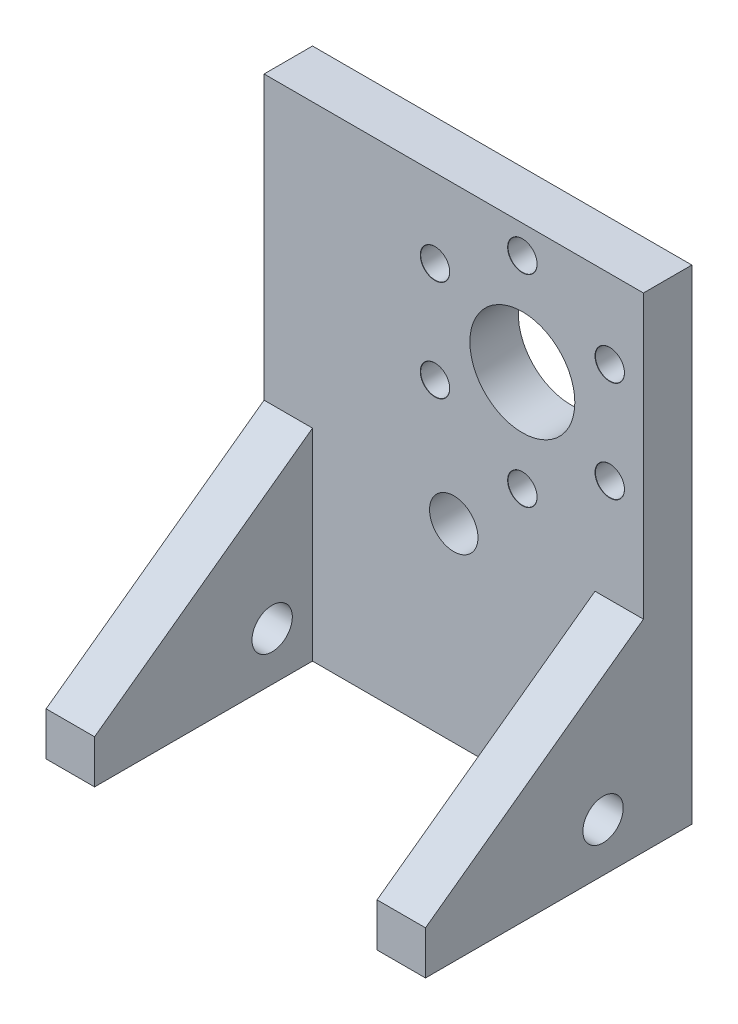
ISO-10303-21;
HEADER;
FILE_DESCRIPTION(('STEP AP214'),'2;1');
FILE_NAME('part.step','',(''),(''),'','','');
FILE_SCHEMA(('AUTOMOTIVE_DESIGN { 1 0 10303 214 1 1 1 1 }'));
ENDSEC;
DATA;
#1=APPLICATION_CONTEXT('core data for automotive mechanical design processes');
#2=APPLICATION_PROTOCOL_DEFINITION('international standard','automotive_design',2000,#1);
#3=PRODUCT_CONTEXT('',#1,'mechanical');
#4=PRODUCT('Part','Part','',(#3));
#5=PRODUCT_RELATED_PRODUCT_CATEGORY('part','',(#4));
#6=PRODUCT_DEFINITION_FORMATION('','',#4);
#7=PRODUCT_DEFINITION_CONTEXT('part definition',#1,'design');
#8=PRODUCT_DEFINITION('design','',#6,#7);
#9=PRODUCT_DEFINITION_SHAPE('','',#8);
#10=(LENGTH_UNIT() NAMED_UNIT(*) SI_UNIT(.MILLI.,.METRE.));
#11=(NAMED_UNIT(*) PLANE_ANGLE_UNIT() SI_UNIT($,.RADIAN.));
#12=(NAMED_UNIT(*) SI_UNIT($,.STERADIAN.) SOLID_ANGLE_UNIT());
#13=UNCERTAINTY_MEASURE_WITH_UNIT(LENGTH_MEASURE(1.E-05),#10,'distance_accuracy_value','');
#14=(GEOMETRIC_REPRESENTATION_CONTEXT(3) GLOBAL_UNCERTAINTY_ASSIGNED_CONTEXT((#13)) GLOBAL_UNIT_ASSIGNED_CONTEXT((#10,
#11,#12)) REPRESENTATION_CONTEXT('',''));
#15=CARTESIAN_POINT('',(0.,0.,0.));
#16=DIRECTION('',(0.,0.,1.));
#17=DIRECTION('',(1.,0.,0.));
#18=AXIS2_PLACEMENT_3D('',#15,#16,#17);
#19=CARTESIAN_POINT('',(-17.5,5.,0.));
#20=DIRECTION('',(-1.,0.,0.));
#21=DIRECTION('',(0.,0.,1.));
#22=AXIS2_PLACEMENT_3D('',#19,#20,#21);
#23=PLANE('',#22);
#24=CARTESIAN_POINT('',(-17.5,6.,5.));
#25=DIRECTION('',(-1.,0.,0.));
#26=DIRECTION('',(0.,0.,1.));
#27=AXIS2_PLACEMENT_3D('',#24,#25,#26);
#28=CIRCLE('',#27,2.5);
#29=CARTESIAN_POINT('',(-17.5,6.,7.5));
#30=VERTEX_POINT('',#29);
#31=EDGE_CURVE('E459',#30,#30,#28,.T.);
#32=ORIENTED_EDGE('',*,*,#31,.T.);
#33=EDGE_LOOP('',(#32));
#34=FACE_BOUND('',#33,.T.);
#35=DIRECTION('',(0.,0.,-1.));
#36=VECTOR('',#35,1.);
#37=CARTESIAN_POINT('',(-17.5,0.,0.));
#38=LINE('',#37,#36);
#39=CARTESIAN_POINT('',(-17.5,0.,27.));
#40=VERTEX_POINT('',#39);
#41=CARTESIAN_POINT('',(-17.5,0.,0.));
#42=VERTEX_POINT('',#41);
#43=EDGE_CURVE('E241',#40,#42,#38,.T.);
#44=ORIENTED_EDGE('',*,*,#43,.T.);
#45=DIRECTION('',(0.,-1.,0.));
#46=VECTOR('',#45,1.);
#47=CARTESIAN_POINT('',(-17.5,5.,0.));
#48=LINE('',#47,#46);
#49=CARTESIAN_POINT('',(-17.5,25.0000000000002,0.));
#50=VERTEX_POINT('',#49);
#51=EDGE_CURVE('E277',#50,#42,#48,.T.);
#52=ORIENTED_EDGE('',*,*,#51,.F.);
#53=DIRECTION('',(0.,-0.58778525229247,0.80901699437495));
#54=VECTOR('',#53,1.);
#55=CARTESIAN_POINT('',(-17.5,18.0901699437497,9.5105651629516));
#56=LINE('',#55,#54);
#57=CARTESIAN_POINT('',(-17.5,5.38335174385562,27.));
#58=VERTEX_POINT('',#57);
#59=EDGE_CURVE('E11',#50,#58,#56,.T.);
#60=ORIENTED_EDGE('',*,*,#59,.T.);
#61=DIRECTION('',(0.,-1.,0.));
#62=VECTOR('',#61,1.);
#63=CARTESIAN_POINT('',(-17.5,5.,27.));
#64=LINE('',#63,#62);
#65=EDGE_CURVE('E60',#58,#40,#64,.T.);
#66=ORIENTED_EDGE('',*,*,#65,.T.);
#67=EDGE_LOOP('',(#44,#52,#60,#66));
#68=FACE_BOUND('',#67,.T.);
#69=ADVANCED_FACE('F44',(#34,#68),#23,.F.);
#70=CARTESIAN_POINT('',(0.,5.,0.));
#71=DIRECTION('',(0.,0.,-1.));
#72=DIRECTION('',(-1.,0.,0.));
#73=AXIS2_PLACEMENT_3D('',#70,#71,#72);
#74=PLANE('',#73);
#75=CARTESIAN_POINT('',(0.,23.5,0.));
#76=DIRECTION('',(0.,0.,1.));
#77=DIRECTION('',(1.,0.,0.));
#78=AXIS2_PLACEMENT_3D('',#75,#76,#77);
#79=CIRCLE('',#78,3.);
#80=CARTESIAN_POINT('',(3.,23.5,0.));
#81=VERTEX_POINT('',#80);
#82=EDGE_CURVE('E460',#81,#81,#79,.T.);
#83=ORIENTED_EDGE('',*,*,#82,.F.);
#84=EDGE_LOOP('',(#83));
#85=FACE_BOUND('',#84,.T.);
#86=CARTESIAN_POINT('',(8.50000000000001,44.,0.));
#87=DIRECTION('',(0.,0.,-1.));
#88=DIRECTION('',(-1.,0.,0.));
#89=AXIS2_PLACEMENT_3D('',#86,#87,#88);
#90=CIRCLE('',#89,6.5);
#91=CARTESIAN_POINT('',(2.00000000000001,44.,0.));
#92=VERTEX_POINT('',#91);
#93=EDGE_CURVE('E168',#92,#92,#90,.T.);
#94=ORIENTED_EDGE('',*,*,#93,.T.);
#95=EDGE_LOOP('',(#94));
#96=FACE_BOUND('',#95,.T.);
#97=CARTESIAN_POINT('',(8.50000000000001,56.5,0.));
#98=DIRECTION('',(0.,0.,1.));
#99=DIRECTION('',(1.,0.,0.));
#100=AXIS2_PLACEMENT_3D('',#97,#98,#99);
#101=CIRCLE('',#100,1.825);
#102=CARTESIAN_POINT('',(10.325,56.5,0.));
#103=VERTEX_POINT('',#102);
#104=EDGE_CURVE('E171',#103,#103,#101,.T.);
#105=ORIENTED_EDGE('',*,*,#104,.F.);
#106=EDGE_LOOP('',(#105));
#107=FACE_BOUND('',#106,.T.);
#108=CARTESIAN_POINT('',(19.3253175473055,50.25,0.));
#109=DIRECTION('',(0.,0.,1.));
#110=DIRECTION('',(1.,0.,0.));
#111=AXIS2_PLACEMENT_3D('',#108,#109,#110);
#112=CIRCLE('',#111,1.825);
#113=CARTESIAN_POINT('',(21.1503175473055,50.25,0.));
#114=VERTEX_POINT('',#113);
#115=EDGE_CURVE('E180',#114,#114,#112,.T.);
#116=ORIENTED_EDGE('',*,*,#115,.F.);
#117=EDGE_LOOP('',(#116));
#118=FACE_BOUND('',#117,.T.);
#119=CARTESIAN_POINT('',(19.3253175473055,37.75,0.));
#120=DIRECTION('',(0.,0.,1.));
#121=DIRECTION('',(1.,0.,0.));
#122=AXIS2_PLACEMENT_3D('',#119,#120,#121);
#123=CIRCLE('',#122,1.825);
#124=CARTESIAN_POINT('',(21.1503175473055,37.75,0.));
#125=VERTEX_POINT('',#124);
#126=EDGE_CURVE('E189',#125,#125,#123,.T.);
#127=ORIENTED_EDGE('',*,*,#126,.F.);
#128=EDGE_LOOP('',(#127));
#129=FACE_BOUND('',#128,.T.);
#130=CARTESIAN_POINT('',(8.50000000000001,31.5,0.));
#131=DIRECTION('',(0.,0.,1.));
#132=DIRECTION('',(1.,0.,0.));
#133=AXIS2_PLACEMENT_3D('',#130,#131,#132);
#134=CIRCLE('',#133,1.825);
#135=CARTESIAN_POINT('',(10.325,31.5,0.));
#136=VERTEX_POINT('',#135);
#137=EDGE_CURVE('E198',#136,#136,#134,.T.);
#138=ORIENTED_EDGE('',*,*,#137,.F.);
#139=EDGE_LOOP('',(#138));
#140=FACE_BOUND('',#139,.T.);
#141=CARTESIAN_POINT('',(-2.32531754730549,37.75,0.));
#142=DIRECTION('',(0.,0.,1.));
#143=DIRECTION('',(1.,0.,0.));
#144=AXIS2_PLACEMENT_3D('',#141,#142,#143);
#145=CIRCLE('',#144,1.825);
#146=CARTESIAN_POINT('',(-0.500317547305486,37.75,0.));
#147=VERTEX_POINT('',#146);
#148=EDGE_CURVE('E207',#147,#147,#145,.T.);
#149=ORIENTED_EDGE('',*,*,#148,.F.);
#150=EDGE_LOOP('',(#149));
#151=FACE_BOUND('',#150,.T.);
#152=CARTESIAN_POINT('',(-2.32531754730547,50.25,0.));
#153=DIRECTION('',(0.,0.,1.));
#154=DIRECTION('',(1.,0.,0.));
#155=AXIS2_PLACEMENT_3D('',#152,#153,#154);
#156=CIRCLE('',#155,1.825);
#157=CARTESIAN_POINT('',(-0.500317547305474,50.25,0.));
#158=VERTEX_POINT('',#157);
#159=EDGE_CURVE('E216',#158,#158,#156,.T.);
#160=ORIENTED_EDGE('',*,*,#159,.F.);
#161=EDGE_LOOP('',(#160));
#162=FACE_BOUND('',#161,.T.);
#163=DIRECTION('',(0.,-1.,0.));
#164=VECTOR('',#163,1.);
#165=CARTESIAN_POINT('',(17.5,5.,0.));
#166=LINE('',#165,#164);
#167=CARTESIAN_POINT('',(17.5,25.0000000000002,0.));
#168=VERTEX_POINT('',#167);
#169=CARTESIAN_POINT('',(17.5,0.,0.));
#170=VERTEX_POINT('',#169);
#171=EDGE_CURVE('E274',#168,#170,#166,.T.);
#172=ORIENTED_EDGE('',*,*,#171,.F.);
#173=DIRECTION('',(1.,0.,0.));
#174=VECTOR('',#173,1.);
#175=CARTESIAN_POINT('',(0.,25.0000000000002,0.));
#176=LINE('',#175,#174);
#177=CARTESIAN_POINT('',(23.5,25.0000000000002,0.));
#178=VERTEX_POINT('',#177);
#179=EDGE_CURVE('E283',#168,#178,#176,.T.);
#180=ORIENTED_EDGE('',*,*,#179,.T.);
#181=DIRECTION('',(0.,-1.,0.));
#182=VECTOR('',#181,1.);
#183=CARTESIAN_POINT('',(23.5,60.,0.));
#184=LINE('',#183,#182);
#185=CARTESIAN_POINT('',(23.5,60.,0.));
#186=VERTEX_POINT('',#185);
#187=EDGE_CURVE('E237',#186,#178,#184,.T.);
#188=ORIENTED_EDGE('',*,*,#187,.F.);
#189=DIRECTION('',(-1.,0.,0.));
#190=VECTOR('',#189,1.);
#191=CARTESIAN_POINT('',(0.,60.,0.));
#192=LINE('',#191,#190);
#193=CARTESIAN_POINT('',(-23.5,60.,0.));
#194=VERTEX_POINT('',#193);
#195=EDGE_CURVE('E231',#186,#194,#192,.T.);
#196=ORIENTED_EDGE('',*,*,#195,.T.);
#197=DIRECTION('',(0.,-1.,0.));
#198=VECTOR('',#197,1.);
#199=CARTESIAN_POINT('',(-23.5,60.,0.));
#200=LINE('',#199,#198);
#201=CARTESIAN_POINT('',(-23.5,25.0000000000002,0.));
#202=VERTEX_POINT('',#201);
#203=EDGE_CURVE('E238',#194,#202,#200,.T.);
#204=ORIENTED_EDGE('',*,*,#203,.T.);
#205=DIRECTION('',(1.,0.,0.));
#206=VECTOR('',#205,1.);
#207=CARTESIAN_POINT('',(0.,25.0000000000002,0.));
#208=LINE('',#207,#206);
#209=EDGE_CURVE('E280',#202,#50,#208,.T.);
#210=ORIENTED_EDGE('',*,*,#209,.T.);
#211=ORIENTED_EDGE('',*,*,#51,.T.);
#212=DIRECTION('',(1.,0.,0.));
#213=VECTOR('',#212,1.);
#214=CARTESIAN_POINT('',(0.,0.,0.));
#215=LINE('',#214,#213);
#216=EDGE_CURVE('E246',#42,#170,#215,.T.);
#217=ORIENTED_EDGE('',*,*,#216,.T.);
#218=EDGE_LOOP('',(#172,#180,#188,#196,#204,#210,#211,#217));
#219=FACE_BOUND('',#218,.T.);
#220=ADVANCED_FACE('F303',(#85,#96,#107,#118,#129,#140,#151,#162,#219),#74,.F.);
#221=CARTESIAN_POINT('',(17.5,5.,0.));
#222=DIRECTION('',(1.,0.,0.));
#223=DIRECTION('',(0.,0.,-1.));
#224=AXIS2_PLACEMENT_3D('',#221,#222,#223);
#225=PLANE('',#224);
#226=CARTESIAN_POINT('',(17.5,6.,5.));
#227=DIRECTION('',(1.,0.,0.));
#228=DIRECTION('',(0.,0.,-1.));
#229=AXIS2_PLACEMENT_3D('',#226,#227,#228);
#230=CIRCLE('',#229,2.5);
#231=CARTESIAN_POINT('',(17.5,6.,2.5));
#232=VERTEX_POINT('',#231);
#233=EDGE_CURVE('E461',#232,#232,#230,.T.);
#234=ORIENTED_EDGE('',*,*,#233,.T.);
#235=EDGE_LOOP('',(#234));
#236=FACE_BOUND('',#235,.T.);
#237=DIRECTION('',(0.,0.,1.));
#238=VECTOR('',#237,1.);
#239=CARTESIAN_POINT('',(17.5,0.,0.));
#240=LINE('',#239,#238);
#241=CARTESIAN_POINT('',(17.5,0.,27.));
#242=VERTEX_POINT('',#241);
#243=EDGE_CURVE('E248',#170,#242,#240,.T.);
#244=ORIENTED_EDGE('',*,*,#243,.T.);
#245=DIRECTION('',(0.,-1.,0.));
#246=VECTOR('',#245,1.);
#247=CARTESIAN_POINT('',(17.5,5.,27.));
#248=LINE('',#247,#246);
#249=CARTESIAN_POINT('',(17.5,5.38335174385562,27.));
#250=VERTEX_POINT('',#249);
#251=EDGE_CURVE('E271',#250,#242,#248,.T.);
#252=ORIENTED_EDGE('',*,*,#251,.F.);
#253=DIRECTION('',(0.,0.58778525229247,-0.80901699437495));
#254=VECTOR('',#253,1.);
#255=CARTESIAN_POINT('',(17.5,18.0901699437497,9.5105651629516));
#256=LINE('',#255,#254);
#257=EDGE_CURVE('E289',#250,#168,#256,.T.);
#258=ORIENTED_EDGE('',*,*,#257,.T.);
#259=ORIENTED_EDGE('',*,*,#171,.T.);
#260=EDGE_LOOP('',(#244,#252,#258,#259));
#261=FACE_BOUND('',#260,.T.);
#262=ADVANCED_FACE('F312',(#236,#261),#225,.F.);
#263=CARTESIAN_POINT('',(0.,5.,27.));
#264=DIRECTION('',(0.,0.,-1.));
#265=DIRECTION('',(-1.,0.,0.));
#266=AXIS2_PLACEMENT_3D('',#263,#264,#265);
#267=PLANE('',#266);
#268=DIRECTION('',(1.,0.,0.));
#269=VECTOR('',#268,1.);
#270=CARTESIAN_POINT('',(0.,0.,27.));
#271=LINE('',#270,#269);
#272=CARTESIAN_POINT('',(23.5,0.,27.));
#273=VERTEX_POINT('',#272);
#274=EDGE_CURVE('E250',#242,#273,#271,.T.);
#275=ORIENTED_EDGE('',*,*,#274,.T.);
#276=DIRECTION('',(0.,-1.,0.));
#277=VECTOR('',#276,1.);
#278=CARTESIAN_POINT('',(23.5,5.,27.));
#279=LINE('',#278,#277);
#280=CARTESIAN_POINT('',(23.5,5.38335174385562,27.));
#281=VERTEX_POINT('',#280);
#282=EDGE_CURVE('E268',#281,#273,#279,.T.);
#283=ORIENTED_EDGE('',*,*,#282,.F.);
#284=DIRECTION('',(-1.,0.,0.));
#285=VECTOR('',#284,1.);
#286=CARTESIAN_POINT('',(0.,5.38335174385565,27.));
#287=LINE('',#286,#285);
#288=EDGE_CURVE('E286',#281,#250,#287,.T.);
#289=ORIENTED_EDGE('',*,*,#288,.T.);
#290=ORIENTED_EDGE('',*,*,#251,.T.);
#291=EDGE_LOOP('',(#275,#283,#289,#290));
#292=FACE_BOUND('',#291,.T.);
#293=ADVANCED_FACE('F320',(#292),#267,.F.);
#294=CARTESIAN_POINT('',(23.5,5.,0.));
#295=DIRECTION('',(-1.,0.,0.));
#296=DIRECTION('',(0.,0.,1.));
#297=AXIS2_PLACEMENT_3D('',#294,#295,#296);
#298=PLANE('',#297);
#299=CARTESIAN_POINT('',(23.5,6.,4.99999999999999));
#300=DIRECTION('',(-1.,0.,0.));
#301=DIRECTION('',(0.,0.,1.));
#302=AXIS2_PLACEMENT_3D('',#299,#300,#301);
#303=CIRCLE('',#302,2.5);
#304=CARTESIAN_POINT('',(23.5,6.,7.5));
#305=VERTEX_POINT('',#304);
#306=EDGE_CURVE('E465',#305,#305,#303,.T.);
#307=ORIENTED_EDGE('',*,*,#306,.T.);
#308=EDGE_LOOP('',(#307));
#309=FACE_BOUND('',#308,.T.);
#310=DIRECTION('',(0.,0.,-1.));
#311=VECTOR('',#310,1.);
#312=CARTESIAN_POINT('',(23.5,0.,0.));
#313=LINE('',#312,#311);
#314=CARTESIAN_POINT('',(23.5,0.,-6.));
#315=VERTEX_POINT('',#314);
#316=EDGE_CURVE('E252',#273,#315,#313,.T.);
#317=ORIENTED_EDGE('',*,*,#316,.T.);
#318=DIRECTION('',(0.,-1.,0.));
#319=VECTOR('',#318,1.);
#320=CARTESIAN_POINT('',(23.5,5.,-6.));
#321=LINE('',#320,#319);
#322=CARTESIAN_POINT('',(23.5,60.,-6.));
#323=VERTEX_POINT('',#322);
#324=EDGE_CURVE('E265',#323,#315,#321,.T.);
#325=ORIENTED_EDGE('',*,*,#324,.F.);
#326=DIRECTION('',(0.,0.,1.));
#327=VECTOR('',#326,1.);
#328=CARTESIAN_POINT('',(23.5,60.,0.));
#329=LINE('',#328,#327);
#330=EDGE_CURVE('E228',#323,#186,#329,.T.);
#331=ORIENTED_EDGE('',*,*,#330,.T.);
#332=ORIENTED_EDGE('',*,*,#187,.T.);
#333=DIRECTION('',(0.,-0.58778525229247,0.80901699437495));
#334=VECTOR('',#333,1.);
#335=CARTESIAN_POINT('',(23.5,18.0901699437497,9.5105651629516));
#336=LINE('',#335,#334);
#337=EDGE_CURVE('E292',#178,#281,#336,.T.);
#338=ORIENTED_EDGE('',*,*,#337,.T.);
#339=ORIENTED_EDGE('',*,*,#282,.T.);
#340=EDGE_LOOP('',(#317,#325,#331,#332,#338,#339));
#341=FACE_BOUND('',#340,.T.);
#342=ADVANCED_FACE('F322',(#309,#341),#298,.F.);
#343=CARTESIAN_POINT('',(0.,5.,-6.));
#344=DIRECTION('',(0.,0.,1.));
#345=DIRECTION('',(1.,0.,0.));
#346=AXIS2_PLACEMENT_3D('',#343,#344,#345);
#347=PLANE('',#346);
#348=CARTESIAN_POINT('',(0.,23.5,-6.));
#349=DIRECTION('',(0.,0.,1.));
#350=DIRECTION('',(1.,0.,0.));
#351=AXIS2_PLACEMENT_3D('',#348,#349,#350);
#352=CIRCLE('',#351,3.);
#353=CARTESIAN_POINT('',(3.,23.5,-6.));
#354=VERTEX_POINT('',#353);
#355=EDGE_CURVE('E48',#354,#354,#352,.T.);
#356=ORIENTED_EDGE('',*,*,#355,.T.);
#357=EDGE_LOOP('',(#356));
#358=FACE_BOUND('',#357,.T.);
#359=CARTESIAN_POINT('',(8.50000000000001,44.,-6.00000000000001));
#360=DIRECTION('',(0.,0.,1.));
#361=DIRECTION('',(1.,0.,0.));
#362=AXIS2_PLACEMENT_3D('',#359,#360,#361);
#363=CIRCLE('',#362,6.5);
#364=CARTESIAN_POINT('',(15.,44.,-6.00000000000001));
#365=VERTEX_POINT('',#364);
#366=EDGE_CURVE('E165',#365,#365,#363,.T.);
#367=ORIENTED_EDGE('',*,*,#366,.T.);
#368=EDGE_LOOP('',(#367));
#369=FACE_BOUND('',#368,.T.);
#370=CARTESIAN_POINT('',(8.50000000000001,56.5,-6.00000000000001));
#371=DIRECTION('',(0.,0.,1.));
#372=DIRECTION('',(1.,0.,0.));
#373=AXIS2_PLACEMENT_3D('',#370,#371,#372);
#374=CIRCLE('',#373,1.79999999999999);
#375=CARTESIAN_POINT('',(10.3,56.5,-6.00000000000001));
#376=VERTEX_POINT('',#375);
#377=EDGE_CURVE('E177',#376,#376,#374,.T.);
#378=ORIENTED_EDGE('',*,*,#377,.T.);
#379=EDGE_LOOP('',(#378));
#380=FACE_BOUND('',#379,.T.);
#381=CARTESIAN_POINT('',(19.3253175473055,50.25,-6.00000000000001));
#382=DIRECTION('',(0.,0.,1.));
#383=DIRECTION('',(1.,0.,0.));
#384=AXIS2_PLACEMENT_3D('',#381,#382,#383);
#385=CIRCLE('',#384,1.79999999999999);
#386=CARTESIAN_POINT('',(21.1253175473055,50.25,-6.00000000000001));
#387=VERTEX_POINT('',#386);
#388=EDGE_CURVE('E186',#387,#387,#385,.T.);
#389=ORIENTED_EDGE('',*,*,#388,.T.);
#390=EDGE_LOOP('',(#389));
#391=FACE_BOUND('',#390,.T.);
#392=CARTESIAN_POINT('',(19.3253175473055,37.75,-6.00000000000001));
#393=DIRECTION('',(0.,0.,1.));
#394=DIRECTION('',(1.,0.,0.));
#395=AXIS2_PLACEMENT_3D('',#392,#393,#394);
#396=CIRCLE('',#395,1.79999999999999);
#397=CARTESIAN_POINT('',(21.1253175473055,37.75,-6.00000000000001));
#398=VERTEX_POINT('',#397);
#399=EDGE_CURVE('E195',#398,#398,#396,.T.);
#400=ORIENTED_EDGE('',*,*,#399,.T.);
#401=EDGE_LOOP('',(#400));
#402=FACE_BOUND('',#401,.T.);
#403=CARTESIAN_POINT('',(8.50000000000001,31.5,-6.00000000000001));
#404=DIRECTION('',(0.,0.,1.));
#405=DIRECTION('',(1.,0.,0.));
#406=AXIS2_PLACEMENT_3D('',#403,#404,#405);
#407=CIRCLE('',#406,1.79999999999999);
#408=CARTESIAN_POINT('',(10.3,31.5,-6.00000000000001));
#409=VERTEX_POINT('',#408);
#410=EDGE_CURVE('E204',#409,#409,#407,.T.);
#411=ORIENTED_EDGE('',*,*,#410,.T.);
#412=EDGE_LOOP('',(#411));
#413=FACE_BOUND('',#412,.T.);
#414=CARTESIAN_POINT('',(-2.32531754730549,37.75,-6.00000000000001));
#415=DIRECTION('',(0.,0.,1.));
#416=DIRECTION('',(1.,0.,0.));
#417=AXIS2_PLACEMENT_3D('',#414,#415,#416);
#418=CIRCLE('',#417,1.79999999999999);
#419=CARTESIAN_POINT('',(-0.525317547305499,37.75,-6.00000000000001));
#420=VERTEX_POINT('',#419);
#421=EDGE_CURVE('E213',#420,#420,#418,.T.);
#422=ORIENTED_EDGE('',*,*,#421,.T.);
#423=EDGE_LOOP('',(#422));
#424=FACE_BOUND('',#423,.T.);
#425=CARTESIAN_POINT('',(-2.32531754730547,50.25,-6.00000000000001));
#426=DIRECTION('',(0.,0.,1.));
#427=DIRECTION('',(1.,0.,0.));
#428=AXIS2_PLACEMENT_3D('',#425,#426,#427);
#429=CIRCLE('',#428,1.79999999999999);
#430=CARTESIAN_POINT('',(-0.525317547305487,50.25,-6.00000000000001));
#431=VERTEX_POINT('',#430);
#432=EDGE_CURVE('E222',#431,#431,#429,.T.);
#433=ORIENTED_EDGE('',*,*,#432,.T.);
#434=EDGE_LOOP('',(#433));
#435=FACE_BOUND('',#434,.T.);
#436=DIRECTION('',(-1.,0.,0.));
#437=VECTOR('',#436,1.);
#438=CARTESIAN_POINT('',(0.,0.,-6.));
#439=LINE('',#438,#437);
#440=CARTESIAN_POINT('',(-23.5,0.,-5.99999999999999));
#441=VERTEX_POINT('',#440);
#442=EDGE_CURVE('E254',#315,#441,#439,.T.);
#443=ORIENTED_EDGE('',*,*,#442,.T.);
#444=DIRECTION('',(0.,-1.,0.));
#445=VECTOR('',#444,1.);
#446=CARTESIAN_POINT('',(-23.5,5.,-5.99999999999999));
#447=LINE('',#446,#445);
#448=CARTESIAN_POINT('',(-23.5,60.,-5.99999999999999));
#449=VERTEX_POINT('',#448);
#450=EDGE_CURVE('E262',#449,#441,#447,.T.);
#451=ORIENTED_EDGE('',*,*,#450,.F.);
#452=DIRECTION('',(1.,0.,0.));
#453=VECTOR('',#452,1.);
#454=CARTESIAN_POINT('',(0.,60.,-6.));
#455=LINE('',#454,#453);
#456=EDGE_CURVE('E225',#449,#323,#455,.T.);
#457=ORIENTED_EDGE('',*,*,#456,.T.);
#458=ORIENTED_EDGE('',*,*,#324,.T.);
#459=EDGE_LOOP('',(#443,#451,#457,#458));
#460=FACE_BOUND('',#459,.T.);
#461=ADVANCED_FACE('F331',(#358,#369,#380,#391,#402,#413,#424,#435,#460),#347,.F.);
#462=CARTESIAN_POINT('',(-23.5,5.,0.));
#463=DIRECTION('',(1.,0.,0.));
#464=DIRECTION('',(0.,0.,-1.));
#465=AXIS2_PLACEMENT_3D('',#462,#463,#464);
#466=PLANE('',#465);
#467=CARTESIAN_POINT('',(-23.5,6.,5.));
#468=DIRECTION('',(-1.,0.,0.));
#469=DIRECTION('',(0.,0.,1.));
#470=AXIS2_PLACEMENT_3D('',#467,#468,#469);
#471=CIRCLE('',#470,2.5);
#472=CARTESIAN_POINT('',(-23.5,6.,7.50000000000001));
#473=VERTEX_POINT('',#472);
#474=EDGE_CURVE('E457',#473,#473,#471,.T.);
#475=ORIENTED_EDGE('',*,*,#474,.F.);
#476=EDGE_LOOP('',(#475));
#477=FACE_BOUND('',#476,.T.);
#478=DIRECTION('',(0.,0.,1.));
#479=VECTOR('',#478,1.);
#480=CARTESIAN_POINT('',(-23.5,0.,0.));
#481=LINE('',#480,#479);
#482=CARTESIAN_POINT('',(-23.5,0.,27.));
#483=VERTEX_POINT('',#482);
#484=EDGE_CURVE('E256',#441,#483,#481,.T.);
#485=ORIENTED_EDGE('',*,*,#484,.T.);
#486=DIRECTION('',(0.,-1.,0.));
#487=VECTOR('',#486,1.);
#488=CARTESIAN_POINT('',(-23.5,5.,27.));
#489=LINE('',#488,#487);
#490=CARTESIAN_POINT('',(-23.5,5.38335174385562,27.));
#491=VERTEX_POINT('',#490);
#492=EDGE_CURVE('E68',#491,#483,#489,.T.);
#493=ORIENTED_EDGE('',*,*,#492,.F.);
#494=DIRECTION('',(0.,0.58778525229247,-0.80901699437495));
#495=VECTOR('',#494,1.);
#496=CARTESIAN_POINT('',(-23.5,18.0901699437497,9.51056516295161));
#497=LINE('',#496,#495);
#498=EDGE_CURVE('E53',#491,#202,#497,.T.);
#499=ORIENTED_EDGE('',*,*,#498,.T.);
#500=ORIENTED_EDGE('',*,*,#203,.F.);
#501=DIRECTION('',(0.,0.,-1.));
#502=VECTOR('',#501,1.);
#503=CARTESIAN_POINT('',(-23.5,60.,0.));
#504=LINE('',#503,#502);
#505=EDGE_CURVE('E234',#194,#449,#504,.T.);
#506=ORIENTED_EDGE('',*,*,#505,.T.);
#507=ORIENTED_EDGE('',*,*,#450,.T.);
#508=EDGE_LOOP('',(#485,#493,#499,#500,#506,#507));
#509=FACE_BOUND('',#508,.T.);
#510=ADVANCED_FACE('F298',(#477,#509),#466,.F.);
#511=CARTESIAN_POINT('',(0.,5.,27.));
#512=DIRECTION('',(0.,0.,-1.));
#513=DIRECTION('',(-1.,0.,0.));
#514=AXIS2_PLACEMENT_3D('',#511,#512,#513);
#515=PLANE('',#514);
#516=DIRECTION('',(1.,0.,0.));
#517=VECTOR('',#516,1.);
#518=CARTESIAN_POINT('',(0.,0.,27.));
#519=LINE('',#518,#517);
#520=EDGE_CURVE('E258',#483,#40,#519,.T.);
#521=ORIENTED_EDGE('',*,*,#520,.T.);
#522=ORIENTED_EDGE('',*,*,#65,.F.);
#523=DIRECTION('',(-1.,0.,0.));
#524=VECTOR('',#523,1.);
#525=CARTESIAN_POINT('',(0.,5.38335174385562,27.));
#526=LINE('',#525,#524);
#527=EDGE_CURVE('E295',#58,#491,#526,.T.);
#528=ORIENTED_EDGE('',*,*,#527,.T.);
#529=ORIENTED_EDGE('',*,*,#492,.T.);
#530=EDGE_LOOP('',(#521,#522,#528,#529));
#531=FACE_BOUND('',#530,.T.);
#532=ADVANCED_FACE('F334',(#531),#515,.F.);
#533=CARTESIAN_POINT('',(0.,0.,0.));
#534=DIRECTION('',(0.,1.,0.));
#535=DIRECTION('',(0.,0.,1.));
#536=AXIS2_PLACEMENT_3D('',#533,#534,#535);
#537=PLANE('',#536);
#538=CARTESIAN_POINT('',(20.5,0.,-3.));
#539=DIRECTION('',(0.,-1.,0.));
#540=DIRECTION('',(0.,0.,-1.));
#541=AXIS2_PLACEMENT_3D('',#538,#539,#540);
#542=CIRCLE('',#541,2.64999999999999);
#543=CARTESIAN_POINT('',(20.5,0.,-5.64999999999999));
#544=VERTEX_POINT('',#543);
#545=EDGE_CURVE('E142',#544,#544,#542,.T.);
#546=ORIENTED_EDGE('',*,*,#545,.F.);
#547=EDGE_LOOP('',(#546));
#548=FACE_BOUND('',#547,.T.);
#549=CARTESIAN_POINT('',(20.5,0.,15.));
#550=DIRECTION('',(0.,-1.,0.));
#551=DIRECTION('',(0.,0.,-1.));
#552=AXIS2_PLACEMENT_3D('',#549,#550,#551);
#553=CIRCLE('',#552,2.64999999999999);
#554=CARTESIAN_POINT('',(20.5,0.,12.35));
#555=VERTEX_POINT('',#554);
#556=EDGE_CURVE('E141',#555,#555,#553,.T.);
#557=ORIENTED_EDGE('',*,*,#556,.F.);
#558=EDGE_LOOP('',(#557));
#559=FACE_BOUND('',#558,.T.);
#560=CARTESIAN_POINT('',(-20.5,0.,-3.));
#561=DIRECTION('',(0.,-1.,0.));
#562=DIRECTION('',(0.,0.,-1.));
#563=AXIS2_PLACEMENT_3D('',#560,#561,#562);
#564=CIRCLE('',#563,2.64999999999999);
#565=CARTESIAN_POINT('',(-20.5,0.,-5.64999999999999));
#566=VERTEX_POINT('',#565);
#567=EDGE_CURVE('E153',#566,#566,#564,.T.);
#568=ORIENTED_EDGE('',*,*,#567,.F.);
#569=EDGE_LOOP('',(#568));
#570=FACE_BOUND('',#569,.T.);
#571=CARTESIAN_POINT('',(-20.5,0.,15.));
#572=DIRECTION('',(0.,-1.,0.));
#573=DIRECTION('',(0.,0.,-1.));
#574=AXIS2_PLACEMENT_3D('',#571,#572,#573);
#575=CIRCLE('',#574,2.64999999999999);
#576=CARTESIAN_POINT('',(-20.5,0.,12.35));
#577=VERTEX_POINT('',#576);
#578=EDGE_CURVE('E159',#577,#577,#575,.T.);
#579=ORIENTED_EDGE('',*,*,#578,.F.);
#580=EDGE_LOOP('',(#579));
#581=FACE_BOUND('',#580,.T.);
#582=ORIENTED_EDGE('',*,*,#43,.F.);
#583=ORIENTED_EDGE('',*,*,#520,.F.);
#584=ORIENTED_EDGE('',*,*,#484,.F.);
#585=ORIENTED_EDGE('',*,*,#442,.F.);
#586=ORIENTED_EDGE('',*,*,#316,.F.);
#587=ORIENTED_EDGE('',*,*,#274,.F.);
#588=ORIENTED_EDGE('',*,*,#243,.F.);
#589=ORIENTED_EDGE('',*,*,#216,.F.);
#590=EDGE_LOOP('',(#582,#583,#584,#585,#586,#587,#588,#589));
#591=FACE_BOUND('',#590,.T.);
#592=ADVANCED_FACE('F316',(#548,#559,#570,#581,#591),#537,.F.);
#593=CARTESIAN_POINT('',(0.,60.,0.));
#594=DIRECTION('',(0.,-1.,0.));
#595=DIRECTION('',(0.,0.,-1.));
#596=AXIS2_PLACEMENT_3D('',#593,#594,#595);
#597=PLANE('',#596);
#598=ORIENTED_EDGE('',*,*,#456,.F.);
#599=ORIENTED_EDGE('',*,*,#505,.F.);
#600=ORIENTED_EDGE('',*,*,#195,.F.);
#601=ORIENTED_EDGE('',*,*,#330,.F.);
#602=EDGE_LOOP('',(#598,#599,#600,#601));
#603=FACE_BOUND('',#602,.T.);
#604=ADVANCED_FACE('F329',(#603),#597,.F.);
#605=CARTESIAN_POINT('',(0.,5.,27.527638409424));
#606=DIRECTION('',(0.,-0.80901699437495,-0.58778525229247));
#607=DIRECTION('',(-1.,0.,0.));
#608=AXIS2_PLACEMENT_3D('',#605,#606,#607);
#609=PLANE('',#608);
#610=ORIENTED_EDGE('',*,*,#337,.F.);
#611=ORIENTED_EDGE('',*,*,#179,.F.);
#612=ORIENTED_EDGE('',*,*,#257,.F.);
#613=ORIENTED_EDGE('',*,*,#288,.F.);
#614=EDGE_LOOP('',(#610,#611,#612,#613));
#615=FACE_BOUND('',#614,.T.);
#616=ADVANCED_FACE('F325',(#615),#609,.F.);
#617=CARTESIAN_POINT('',(0.,5.,27.527638409424));
#618=DIRECTION('',(0.,-0.80901699437495,-0.58778525229247));
#619=DIRECTION('',(-1.,0.,0.));
#620=AXIS2_PLACEMENT_3D('',#617,#618,#619);
#621=PLANE('',#620);
#622=ORIENTED_EDGE('',*,*,#59,.F.);
#623=ORIENTED_EDGE('',*,*,#209,.F.);
#624=ORIENTED_EDGE('',*,*,#498,.F.);
#625=ORIENTED_EDGE('',*,*,#527,.F.);
#626=EDGE_LOOP('',(#622,#623,#624,#625));
#627=FACE_BOUND('',#626,.T.);
#628=ADVANCED_FACE('F46',(#627),#621,.F.);
#629=CARTESIAN_POINT('',(-2.32531754730547,50.25,0.));
#630=DIRECTION('',(0.,0.,1.));
#631=DIRECTION('',(1.,0.,0.));
#632=AXIS2_PLACEMENT_3D('',#629,#630,#631);
#633=CYLINDRICAL_SURFACE('',#632,1.79999999999999);
#634=ORIENTED_EDGE('',*,*,#432,.F.);
#635=EDGE_LOOP('',(#634));
#636=FACE_BOUND('',#635,.T.);
#637=CARTESIAN_POINT('',(-2.32531754730547,50.25,-0.0249999999999998));
#638=DIRECTION('',(0.,0.,1.));
#639=DIRECTION('',(1.,0.,0.));
#640=AXIS2_PLACEMENT_3D('',#637,#638,#639);
#641=CIRCLE('',#640,1.8);
#642=CARTESIAN_POINT('',(-0.525317547305475,50.25,-0.0249999999999998));
#643=VERTEX_POINT('',#642);
#644=EDGE_CURVE('E219',#643,#643,#641,.T.);
#645=ORIENTED_EDGE('',*,*,#644,.T.);
#646=EDGE_LOOP('',(#645));
#647=FACE_BOUND('',#646,.T.);
#648=ADVANCED_FACE('F361',(#636,#647),#633,.F.);
#649=CARTESIAN_POINT('',(-2.32531754730547,50.25,0.));
#650=DIRECTION('',(0.,0.,1.));
#651=DIRECTION('',(1.,0.,0.));
#652=AXIS2_PLACEMENT_3D('',#649,#650,#651);
#653=CONICAL_SURFACE('',#652,1.825,0.785398163397435);
#654=ORIENTED_EDGE('',*,*,#644,.F.);
#655=EDGE_LOOP('',(#654));
#656=FACE_BOUND('',#655,.T.);
#657=ORIENTED_EDGE('',*,*,#159,.T.);
#658=EDGE_LOOP('',(#657));
#659=FACE_BOUND('',#658,.T.);
#660=ADVANCED_FACE('F368',(#656,#659),#653,.F.);
#661=CARTESIAN_POINT('',(-2.32531754730549,37.75,0.));
#662=DIRECTION('',(0.,0.,1.));
#663=DIRECTION('',(1.,0.,0.));
#664=AXIS2_PLACEMENT_3D('',#661,#662,#663);
#665=CYLINDRICAL_SURFACE('',#664,1.79999999999999);
#666=ORIENTED_EDGE('',*,*,#421,.F.);
#667=EDGE_LOOP('',(#666));
#668=FACE_BOUND('',#667,.T.);
#669=CARTESIAN_POINT('',(-2.32531754730549,37.75,-0.0249999999999998));
#670=DIRECTION('',(0.,0.,1.));
#671=DIRECTION('',(1.,0.,0.));
#672=AXIS2_PLACEMENT_3D('',#669,#670,#671);
#673=CIRCLE('',#672,1.8);
#674=CARTESIAN_POINT('',(-0.525317547305487,37.75,-0.0249999999999998));
#675=VERTEX_POINT('',#674);
#676=EDGE_CURVE('E210',#675,#675,#673,.T.);
#677=ORIENTED_EDGE('',*,*,#676,.T.);
#678=EDGE_LOOP('',(#677));
#679=FACE_BOUND('',#678,.T.);
#680=ADVANCED_FACE('F372',(#668,#679),#665,.F.);
#681=CARTESIAN_POINT('',(-2.32531754730549,37.75,0.));
#682=DIRECTION('',(0.,0.,1.));
#683=DIRECTION('',(1.,0.,0.));
#684=AXIS2_PLACEMENT_3D('',#681,#682,#683);
#685=CONICAL_SURFACE('',#684,1.825,0.785398163397435);
#686=ORIENTED_EDGE('',*,*,#676,.F.);
#687=EDGE_LOOP('',(#686));
#688=FACE_BOUND('',#687,.T.);
#689=ORIENTED_EDGE('',*,*,#148,.T.);
#690=EDGE_LOOP('',(#689));
#691=FACE_BOUND('',#690,.T.);
#692=ADVANCED_FACE('F376',(#688,#691),#685,.F.);
#693=CARTESIAN_POINT('',(8.50000000000001,31.5,0.));
#694=DIRECTION('',(0.,0.,1.));
#695=DIRECTION('',(1.,0.,0.));
#696=AXIS2_PLACEMENT_3D('',#693,#694,#695);
#697=CYLINDRICAL_SURFACE('',#696,1.79999999999999);
#698=ORIENTED_EDGE('',*,*,#410,.F.);
#699=EDGE_LOOP('',(#698));
#700=FACE_BOUND('',#699,.T.);
#701=CARTESIAN_POINT('',(8.50000000000001,31.5,-0.0249999999999998));
#702=DIRECTION('',(0.,0.,1.));
#703=DIRECTION('',(1.,0.,0.));
#704=AXIS2_PLACEMENT_3D('',#701,#702,#703);
#705=CIRCLE('',#704,1.8);
#706=CARTESIAN_POINT('',(10.3,31.5,-0.0249999999999998));
#707=VERTEX_POINT('',#706);
#708=EDGE_CURVE('E201',#707,#707,#705,.T.);
#709=ORIENTED_EDGE('',*,*,#708,.T.);
#710=EDGE_LOOP('',(#709));
#711=FACE_BOUND('',#710,.T.);
#712=ADVANCED_FACE('F380',(#700,#711),#697,.F.);
#713=CARTESIAN_POINT('',(8.50000000000001,31.5,0.));
#714=DIRECTION('',(0.,0.,1.));
#715=DIRECTION('',(1.,0.,0.));
#716=AXIS2_PLACEMENT_3D('',#713,#714,#715);
#717=CONICAL_SURFACE('',#716,1.825,0.785398163397431);
#718=ORIENTED_EDGE('',*,*,#708,.F.);
#719=EDGE_LOOP('',(#718));
#720=FACE_BOUND('',#719,.T.);
#721=ORIENTED_EDGE('',*,*,#137,.T.);
#722=EDGE_LOOP('',(#721));
#723=FACE_BOUND('',#722,.T.);
#724=ADVANCED_FACE('F384',(#720,#723),#717,.F.);
#725=CARTESIAN_POINT('',(19.3253175473055,37.75,0.));
#726=DIRECTION('',(0.,0.,1.));
#727=DIRECTION('',(1.,0.,0.));
#728=AXIS2_PLACEMENT_3D('',#725,#726,#727);
#729=CYLINDRICAL_SURFACE('',#728,1.79999999999999);
#730=ORIENTED_EDGE('',*,*,#399,.F.);
#731=EDGE_LOOP('',(#730));
#732=FACE_BOUND('',#731,.T.);
#733=CARTESIAN_POINT('',(19.3253175473055,37.75,-0.0249999999999998));
#734=DIRECTION('',(0.,0.,1.));
#735=DIRECTION('',(1.,0.,0.));
#736=AXIS2_PLACEMENT_3D('',#733,#734,#735);
#737=CIRCLE('',#736,1.8);
#738=CARTESIAN_POINT('',(21.1253175473055,37.75,-0.0249999999999998));
#739=VERTEX_POINT('',#738);
#740=EDGE_CURVE('E192',#739,#739,#737,.T.);
#741=ORIENTED_EDGE('',*,*,#740,.T.);
#742=EDGE_LOOP('',(#741));
#743=FACE_BOUND('',#742,.T.);
#744=ADVANCED_FACE('F388',(#732,#743),#729,.F.);
#745=CARTESIAN_POINT('',(19.3253175473055,37.75,0.));
#746=DIRECTION('',(0.,0.,1.));
#747=DIRECTION('',(1.,0.,0.));
#748=AXIS2_PLACEMENT_3D('',#745,#746,#747);
#749=CONICAL_SURFACE('',#748,1.825,0.785398163397431);
#750=ORIENTED_EDGE('',*,*,#740,.F.);
#751=EDGE_LOOP('',(#750));
#752=FACE_BOUND('',#751,.T.);
#753=ORIENTED_EDGE('',*,*,#126,.T.);
#754=EDGE_LOOP('',(#753));
#755=FACE_BOUND('',#754,.T.);
#756=ADVANCED_FACE('F392',(#752,#755),#749,.F.);
#757=CARTESIAN_POINT('',(19.3253175473055,50.25,0.));
#758=DIRECTION('',(0.,0.,1.));
#759=DIRECTION('',(1.,0.,0.));
#760=AXIS2_PLACEMENT_3D('',#757,#758,#759);
#761=CYLINDRICAL_SURFACE('',#760,1.79999999999999);
#762=ORIENTED_EDGE('',*,*,#388,.F.);
#763=EDGE_LOOP('',(#762));
#764=FACE_BOUND('',#763,.T.);
#765=CARTESIAN_POINT('',(19.3253175473055,50.25,-0.0249999999999998));
#766=DIRECTION('',(0.,0.,1.));
#767=DIRECTION('',(1.,0.,0.));
#768=AXIS2_PLACEMENT_3D('',#765,#766,#767);
#769=CIRCLE('',#768,1.8);
#770=CARTESIAN_POINT('',(21.1253175473055,50.25,-0.0249999999999998));
#771=VERTEX_POINT('',#770);
#772=EDGE_CURVE('E183',#771,#771,#769,.T.);
#773=ORIENTED_EDGE('',*,*,#772,.T.);
#774=EDGE_LOOP('',(#773));
#775=FACE_BOUND('',#774,.T.);
#776=ADVANCED_FACE('F396',(#764,#775),#761,.F.);
#777=CARTESIAN_POINT('',(19.3253175473055,50.25,0.));
#778=DIRECTION('',(0.,0.,1.));
#779=DIRECTION('',(1.,0.,0.));
#780=AXIS2_PLACEMENT_3D('',#777,#778,#779);
#781=CONICAL_SURFACE('',#780,1.825,0.785398163397431);
#782=ORIENTED_EDGE('',*,*,#772,.F.);
#783=EDGE_LOOP('',(#782));
#784=FACE_BOUND('',#783,.T.);
#785=ORIENTED_EDGE('',*,*,#115,.T.);
#786=EDGE_LOOP('',(#785));
#787=FACE_BOUND('',#786,.T.);
#788=ADVANCED_FACE('F400',(#784,#787),#781,.F.);
#789=CARTESIAN_POINT('',(8.50000000000001,56.5,0.));
#790=DIRECTION('',(0.,0.,1.));
#791=DIRECTION('',(1.,0.,0.));
#792=AXIS2_PLACEMENT_3D('',#789,#790,#791);
#793=CYLINDRICAL_SURFACE('',#792,1.79999999999999);
#794=ORIENTED_EDGE('',*,*,#377,.F.);
#795=EDGE_LOOP('',(#794));
#796=FACE_BOUND('',#795,.T.);
#797=CARTESIAN_POINT('',(8.50000000000001,56.5,-0.0249999999999998));
#798=DIRECTION('',(0.,0.,1.));
#799=DIRECTION('',(1.,0.,0.));
#800=AXIS2_PLACEMENT_3D('',#797,#798,#799);
#801=CIRCLE('',#800,1.8);
#802=CARTESIAN_POINT('',(10.3,56.5,-0.0249999999999998));
#803=VERTEX_POINT('',#802);
#804=EDGE_CURVE('E174',#803,#803,#801,.T.);
#805=ORIENTED_EDGE('',*,*,#804,.T.);
#806=EDGE_LOOP('',(#805));
#807=FACE_BOUND('',#806,.T.);
#808=ADVANCED_FACE('F404',(#796,#807),#793,.F.);
#809=CARTESIAN_POINT('',(8.50000000000001,56.5,0.));
#810=DIRECTION('',(0.,0.,1.));
#811=DIRECTION('',(1.,0.,0.));
#812=AXIS2_PLACEMENT_3D('',#809,#810,#811);
#813=CONICAL_SURFACE('',#812,1.825,0.785398163397431);
#814=ORIENTED_EDGE('',*,*,#804,.F.);
#815=EDGE_LOOP('',(#814));
#816=FACE_BOUND('',#815,.T.);
#817=ORIENTED_EDGE('',*,*,#104,.T.);
#818=EDGE_LOOP('',(#817));
#819=FACE_BOUND('',#818,.T.);
#820=ADVANCED_FACE('F408',(#816,#819),#813,.F.);
#821=CARTESIAN_POINT('',(8.50000000000001,44.,-6.00000000000001));
#822=DIRECTION('',(0.,0.,1.));
#823=DIRECTION('',(1.,0.,0.));
#824=AXIS2_PLACEMENT_3D('',#821,#822,#823);
#825=CYLINDRICAL_SURFACE('',#824,6.5);
#826=ORIENTED_EDGE('',*,*,#366,.F.);
#827=EDGE_LOOP('',(#826));
#828=FACE_BOUND('',#827,.T.);
#829=ORIENTED_EDGE('',*,*,#93,.F.);
#830=EDGE_LOOP('',(#829));
#831=FACE_BOUND('',#830,.T.);
#832=ADVANCED_FACE('F412',(#828,#831),#825,.F.);
#833=CARTESIAN_POINT('',(-20.5,7.,15.));
#834=DIRECTION('',(0.,-1.,0.));
#835=DIRECTION('',(0.,0.,-1.));
#836=AXIS2_PLACEMENT_3D('',#833,#834,#835);
#837=CONICAL_SURFACE('',#836,2.65,1.02974425867665);
#838=CARTESIAN_POINT('',(-20.5,8.59228064042303,15.));
#839=VERTEX_POINT('',#838);
#840=VERTEX_LOOP('',#839);
#841=FACE_BOUND('',#840,.T.);
#842=CARTESIAN_POINT('',(-20.5,7.,15.));
#843=DIRECTION('',(0.,-1.,0.));
#844=DIRECTION('',(0.,0.,-1.));
#845=AXIS2_PLACEMENT_3D('',#842,#843,#844);
#846=CIRCLE('',#845,2.65);
#847=CARTESIAN_POINT('',(-20.5,7.,12.35));
#848=VERTEX_POINT('',#847);
#849=EDGE_CURVE('E162',#848,#848,#846,.T.);
#850=ORIENTED_EDGE('',*,*,#849,.T.);
#851=EDGE_LOOP('',(#850));
#852=FACE_BOUND('',#851,.T.);
#853=ADVANCED_FACE('F416',(#841,#852),#837,.F.);
#854=CARTESIAN_POINT('',(-20.5,0.,15.));
#855=DIRECTION('',(0.,-1.,0.));
#856=DIRECTION('',(0.,0.,-1.));
#857=AXIS2_PLACEMENT_3D('',#854,#855,#856);
#858=CYLINDRICAL_SURFACE('',#857,2.64999999999999);
#859=ORIENTED_EDGE('',*,*,#849,.F.);
#860=EDGE_LOOP('',(#859));
#861=FACE_BOUND('',#860,.T.);
#862=ORIENTED_EDGE('',*,*,#578,.T.);
#863=EDGE_LOOP('',(#862));
#864=FACE_BOUND('',#863,.T.);
#865=ADVANCED_FACE('F420',(#861,#864),#858,.F.);
#866=CARTESIAN_POINT('',(-20.5,7.,-3.));
#867=DIRECTION('',(0.,-1.,0.));
#868=DIRECTION('',(0.,0.,-1.));
#869=AXIS2_PLACEMENT_3D('',#866,#867,#868);
#870=CONICAL_SURFACE('',#869,2.65,1.02974425867665);
#871=CARTESIAN_POINT('',(-20.5,8.59228064042303,-3.));
#872=VERTEX_POINT('',#871);
#873=VERTEX_LOOP('',#872);
#874=FACE_BOUND('',#873,.T.);
#875=CARTESIAN_POINT('',(-20.5,7.,-3.));
#876=DIRECTION('',(0.,-1.,0.));
#877=DIRECTION('',(0.,0.,-1.));
#878=AXIS2_PLACEMENT_3D('',#875,#876,#877);
#879=CIRCLE('',#878,2.65);
#880=CARTESIAN_POINT('',(-20.5,7.,-5.65));
#881=VERTEX_POINT('',#880);
#882=EDGE_CURVE('E156',#881,#881,#879,.T.);
#883=ORIENTED_EDGE('',*,*,#882,.T.);
#884=EDGE_LOOP('',(#883));
#885=FACE_BOUND('',#884,.T.);
#886=ADVANCED_FACE('F424',(#874,#885),#870,.F.);
#887=CARTESIAN_POINT('',(-20.5,0.,-3.));
#888=DIRECTION('',(0.,-1.,0.));
#889=DIRECTION('',(0.,0.,-1.));
#890=AXIS2_PLACEMENT_3D('',#887,#888,#889);
#891=CYLINDRICAL_SURFACE('',#890,2.64999999999999);
#892=ORIENTED_EDGE('',*,*,#882,.F.);
#893=EDGE_LOOP('',(#892));
#894=FACE_BOUND('',#893,.T.);
#895=ORIENTED_EDGE('',*,*,#567,.T.);
#896=EDGE_LOOP('',(#895));
#897=FACE_BOUND('',#896,.T.);
#898=ADVANCED_FACE('F428',(#894,#897),#891,.F.);
#899=CARTESIAN_POINT('',(20.5,7.,15.));
#900=DIRECTION('',(0.,-1.,0.));
#901=DIRECTION('',(0.,0.,-1.));
#902=AXIS2_PLACEMENT_3D('',#899,#900,#901);
#903=CONICAL_SURFACE('',#902,2.65,1.02974425867665);
#904=CARTESIAN_POINT('',(20.5,8.59228064042303,15.));
#905=VERTEX_POINT('',#904);
#906=VERTEX_LOOP('',#905);
#907=FACE_BOUND('',#906,.T.);
#908=CARTESIAN_POINT('',(20.5,7.,15.));
#909=DIRECTION('',(0.,-1.,0.));
#910=DIRECTION('',(0.,0.,-1.));
#911=AXIS2_PLACEMENT_3D('',#908,#909,#910);
#912=CIRCLE('',#911,2.65);
#913=CARTESIAN_POINT('',(20.5,7.,12.35));
#914=VERTEX_POINT('',#913);
#915=EDGE_CURVE('E145',#914,#914,#912,.T.);
#916=ORIENTED_EDGE('',*,*,#915,.T.);
#917=EDGE_LOOP('',(#916));
#918=FACE_BOUND('',#917,.T.);
#919=ADVANCED_FACE('F432',(#907,#918),#903,.F.);
#920=CARTESIAN_POINT('',(20.5,0.,15.));
#921=DIRECTION('',(0.,-1.,0.));
#922=DIRECTION('',(0.,0.,-1.));
#923=AXIS2_PLACEMENT_3D('',#920,#921,#922);
#924=CYLINDRICAL_SURFACE('',#923,2.64999999999999);
#925=ORIENTED_EDGE('',*,*,#915,.F.);
#926=EDGE_LOOP('',(#925));
#927=FACE_BOUND('',#926,.T.);
#928=ORIENTED_EDGE('',*,*,#556,.T.);
#929=EDGE_LOOP('',(#928));
#930=FACE_BOUND('',#929,.T.);
#931=ADVANCED_FACE('F135',(#927,#930),#924,.F.);
#932=CARTESIAN_POINT('',(20.5,7.,-3.));
#933=DIRECTION('',(0.,-1.,0.));
#934=DIRECTION('',(0.,0.,-1.));
#935=AXIS2_PLACEMENT_3D('',#932,#933,#934);
#936=CONICAL_SURFACE('',#935,2.65,1.02974425867665);
#937=CARTESIAN_POINT('',(20.5,8.59228064042303,-3.));
#938=VERTEX_POINT('',#937);
#939=VERTEX_LOOP('',#938);
#940=FACE_BOUND('',#939,.T.);
#941=CARTESIAN_POINT('',(20.5,7.,-3.));
#942=DIRECTION('',(0.,-1.,0.));
#943=DIRECTION('',(0.,0.,-1.));
#944=AXIS2_PLACEMENT_3D('',#941,#942,#943);
#945=CIRCLE('',#944,2.65);
#946=CARTESIAN_POINT('',(20.5,7.,-5.65));
#947=VERTEX_POINT('',#946);
#948=EDGE_CURVE('E139',#947,#947,#945,.T.);
#949=ORIENTED_EDGE('',*,*,#948,.T.);
#950=EDGE_LOOP('',(#949));
#951=FACE_BOUND('',#950,.T.);
#952=ADVANCED_FACE('F131',(#940,#951),#936,.F.);
#953=CARTESIAN_POINT('',(20.5,0.,-3.));
#954=DIRECTION('',(0.,-1.,0.));
#955=DIRECTION('',(0.,0.,-1.));
#956=AXIS2_PLACEMENT_3D('',#953,#954,#955);
#957=CYLINDRICAL_SURFACE('',#956,2.64999999999999);
#958=ORIENTED_EDGE('',*,*,#948,.F.);
#959=EDGE_LOOP('',(#958));
#960=FACE_BOUND('',#959,.T.);
#961=ORIENTED_EDGE('',*,*,#545,.T.);
#962=EDGE_LOOP('',(#961));
#963=FACE_BOUND('',#962,.T.);
#964=ADVANCED_FACE('F134',(#960,#963),#957,.F.);
#965=CARTESIAN_POINT('',(0.,23.5,-10.));
#966=DIRECTION('',(0.,0.,1.));
#967=DIRECTION('',(1.,0.,0.));
#968=AXIS2_PLACEMENT_3D('',#965,#966,#967);
#969=CYLINDRICAL_SURFACE('',#968,3.);
#970=ORIENTED_EDGE('',*,*,#82,.T.);
#971=EDGE_LOOP('',(#970));
#972=FACE_BOUND('',#971,.T.);
#973=ORIENTED_EDGE('',*,*,#355,.F.);
#974=EDGE_LOOP('',(#973));
#975=FACE_BOUND('',#974,.T.);
#976=ADVANCED_FACE('F442',(#972,#975),#969,.F.);
#977=CARTESIAN_POINT('',(23.5,6.,4.99999999999999));
#978=DIRECTION('',(-1.,0.,0.));
#979=DIRECTION('',(0.,0.,1.));
#980=AXIS2_PLACEMENT_3D('',#977,#978,#979);
#981=CYLINDRICAL_SURFACE('',#980,2.5);
#982=ORIENTED_EDGE('',*,*,#474,.T.);
#983=EDGE_LOOP('',(#982));
#984=FACE_BOUND('',#983,.T.);
#985=ORIENTED_EDGE('',*,*,#31,.F.);
#986=EDGE_LOOP('',(#985));
#987=FACE_BOUND('',#986,.T.);
#988=ADVANCED_FACE('F445',(#984,#987),#981,.F.);
#989=ORIENTED_EDGE('',*,*,#306,.F.);
#990=EDGE_LOOP('',(#989));
#991=FACE_BOUND('',#990,.T.);
#992=ORIENTED_EDGE('',*,*,#233,.F.);
#993=EDGE_LOOP('',(#992));
#994=FACE_BOUND('',#993,.T.);
#995=ADVANCED_FACE('F448',(#991,#994),#981,.F.);
#996=CLOSED_SHELL('',(#69,#220,#262,#293,#342,#461,#510,#532,#592,#604,#616,#628,#648,#660,#680,
#692,#712,#724,#744,#756,#776,#788,#808,#820,#832,#853,#865,#886,#898,#919,#931,#952,#964,#976,
#988,#995));
#997=MANIFOLD_SOLID_BREP('B2',#996);
#998=ADVANCED_BREP_SHAPE_REPRESENTATION('',(#18,#997),#14);
#999=SHAPE_DEFINITION_REPRESENTATION(#9,#998);
ENDSEC;
END-ISO-10303-21;
